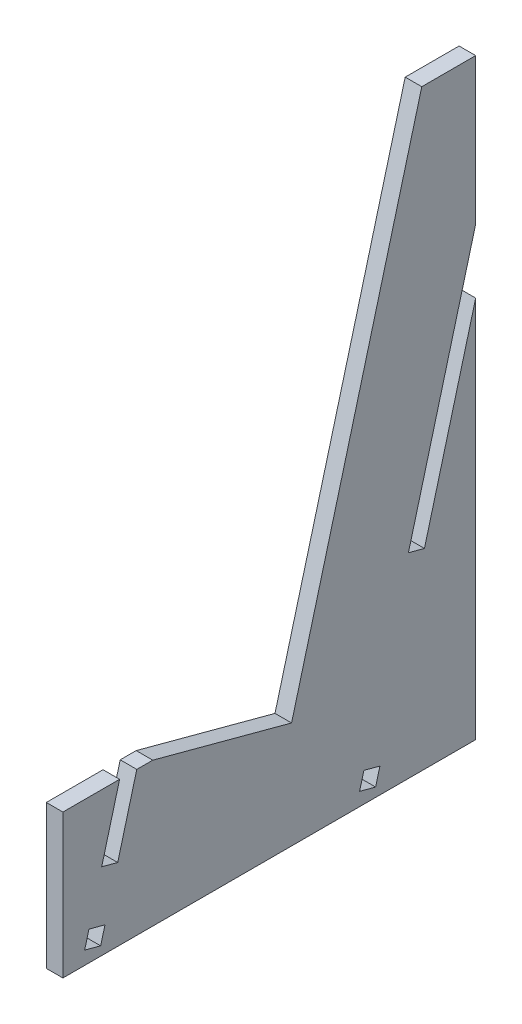
ISO-10303-21;
HEADER;
FILE_DESCRIPTION(('STEP AP214'),'2;1');
FILE_NAME('part.step','',(''),(''),'','','');
FILE_SCHEMA(('AUTOMOTIVE_DESIGN { 1 0 10303 214 1 1 1 1 }'));
ENDSEC;
DATA;
#1=APPLICATION_CONTEXT('core data for automotive mechanical design processes');
#2=APPLICATION_PROTOCOL_DEFINITION('international standard','automotive_design',2000,#1);
#3=PRODUCT_CONTEXT('',#1,'mechanical');
#4=PRODUCT('Part','Part','',(#3));
#5=PRODUCT_RELATED_PRODUCT_CATEGORY('part','',(#4));
#6=PRODUCT_DEFINITION_FORMATION('','',#4);
#7=PRODUCT_DEFINITION_CONTEXT('part definition',#1,'design');
#8=PRODUCT_DEFINITION('design','',#6,#7);
#9=PRODUCT_DEFINITION_SHAPE('','',#8);
#10=(LENGTH_UNIT() NAMED_UNIT(*) SI_UNIT(.MILLI.,.METRE.));
#11=(NAMED_UNIT(*) PLANE_ANGLE_UNIT() SI_UNIT($,.RADIAN.));
#12=(NAMED_UNIT(*) SI_UNIT($,.STERADIAN.) SOLID_ANGLE_UNIT());
#13=UNCERTAINTY_MEASURE_WITH_UNIT(LENGTH_MEASURE(1.E-05),#10,'distance_accuracy_value','');
#14=(GEOMETRIC_REPRESENTATION_CONTEXT(3) GLOBAL_UNCERTAINTY_ASSIGNED_CONTEXT((#13)) GLOBAL_UNIT_ASSIGNED_CONTEXT((#10,
#11,#12)) REPRESENTATION_CONTEXT('',''));
#15=CARTESIAN_POINT('',(0.,0.,0.));
#16=DIRECTION('',(0.,0.,1.));
#17=DIRECTION('',(1.,0.,0.));
#18=AXIS2_PLACEMENT_3D('',#15,#16,#17);
#19=CARTESIAN_POINT('',(2.93,0.,0.));
#20=DIRECTION('',(1.,0.,0.));
#21=DIRECTION('',(0.,0.,-1.));
#22=AXIS2_PLACEMENT_3D('',#19,#20,#21);
#23=PLANE('',#22);
#24=DIRECTION('',(0.,-0.96592582628907,0.258819045102513));
#25=VECTOR('',#24,1.);
#26=CARTESIAN_POINT('',(2.93,1.59227051614985,17.6834074311444));
#27=LINE('',#26,#25);
#28=CARTESIAN_POINT('',(2.93,4.42243318717682,16.925067628994));
#29=VERTEX_POINT('',#28);
#30=CARTESIAN_POINT('',(2.93,1.59227051614985,17.6834074311444));
#31=VERTEX_POINT('',#30);
#32=EDGE_CURVE('E194',#29,#31,#27,.T.);
#33=ORIENTED_EDGE('',*,*,#32,.T.);
#34=DIRECTION('',(0.,0.258819045102514,0.96592582628907));
#35=VECTOR('',#34,1.);
#36=CARTESIAN_POINT('',(2.93,1.59227051614985,17.6834074311444));
#37=LINE('',#36,#35);
#38=CARTESIAN_POINT('',(2.93,2.35061031830021,20.5135701021713));
#39=VERTEX_POINT('',#38);
#40=EDGE_CURVE('E203',#31,#39,#37,.T.);
#41=ORIENTED_EDGE('',*,*,#40,.T.);
#42=DIRECTION('',(0.,0.96592582628907,-0.258819045102513));
#43=VECTOR('',#42,1.);
#44=CARTESIAN_POINT('',(2.93,2.35061031830021,20.5135701021713));
#45=LINE('',#44,#43);
#46=CARTESIAN_POINT('',(2.93,5.18077298932718,19.755230300021));
#47=VERTEX_POINT('',#46);
#48=EDGE_CURVE('E52',#39,#47,#45,.T.);
#49=ORIENTED_EDGE('',*,*,#48,.T.);
#50=DIRECTION('',(0.,-0.258819045102514,-0.96592582628907));
#51=VECTOR('',#50,1.);
#52=CARTESIAN_POINT('',(2.93,4.42243318717682,16.925067628994));
#53=LINE('',#52,#51);
#54=EDGE_CURVE('E200',#47,#29,#53,.T.);
#55=ORIENTED_EDGE('',*,*,#54,.T.);
#56=EDGE_LOOP('',(#33,#41,#49,#55));
#57=FACE_BOUND('',#56,.T.);
#58=DIRECTION('',(0.,-0.96592582628907,0.258819045102515));
#59=VECTOR('',#58,1.);
#60=CARTESIAN_POINT('',(2.93,12.8324905834679,63.2566152430916));
#61=LINE('',#60,#59);
#62=CARTESIAN_POINT('',(2.93,25.4,59.8891612440614));
#63=VERTEX_POINT('',#62);
#64=CARTESIAN_POINT('',(2.93,12.8324905834679,63.2566152430916));
#65=VERTEX_POINT('',#64);
#66=EDGE_CURVE('E259',#63,#65,#61,.T.);
#67=ORIENTED_EDGE('',*,*,#66,.T.);
#68=DIRECTION('',(0.,0.258819045102516,0.96592582628907));
#69=VECTOR('',#68,1.);
#70=CARTESIAN_POINT('',(2.93,12.8324905834679,63.2566152430916));
#71=LINE('',#70,#69);
#72=CARTESIAN_POINT('',(2.93,13.5908303856183,66.0867779141186));
#73=VERTEX_POINT('',#72);
#74=EDGE_CURVE('E262',#65,#73,#71,.T.);
#75=ORIENTED_EDGE('',*,*,#74,.T.);
#76=DIRECTION('',(0.,0.96592582628907,-0.258819045102515));
#77=VECTOR('',#76,1.);
#78=CARTESIAN_POINT('',(2.93,13.5908303856183,66.0867779141186));
#79=LINE('',#78,#77);
#80=CARTESIAN_POINT('',(2.93,25.4,62.9225204526629));
#81=VERTEX_POINT('',#80);
#82=EDGE_CURVE('E266',#73,#81,#79,.T.);
#83=ORIENTED_EDGE('',*,*,#82,.T.);
#84=DIRECTION('',(0.,0.,1.));
#85=VECTOR('',#84,1.);
#86=CARTESIAN_POINT('',(2.93,25.4,57.0685290973559));
#87=LINE('',#86,#85);
#88=CARTESIAN_POINT('',(2.93,25.4,72.9435290973559));
#89=VERTEX_POINT('',#88);
#90=EDGE_CURVE('E322',#81,#89,#87,.T.);
#91=ORIENTED_EDGE('',*,*,#90,.T.);
#92=DIRECTION('',(0.,-1.,0.));
#93=VECTOR('',#92,1.);
#94=CARTESIAN_POINT('',(2.93,25.4,72.9435290973559));
#95=LINE('',#94,#93);
#96=CARTESIAN_POINT('',(2.93,0.,72.9435290973559));
#97=VERTEX_POINT('',#96);
#98=EDGE_CURVE('E326',#89,#97,#95,.T.);
#99=ORIENTED_EDGE('',*,*,#98,.T.);
#100=DIRECTION('',(0.,0.,-1.));
#101=VECTOR('',#100,1.);
#102=CARTESIAN_POINT('',(2.93,0.,72.9435290973559));
#103=LINE('',#102,#101);
#104=CARTESIAN_POINT('',(2.93,0.,0.));
#105=VERTEX_POINT('',#104);
#106=EDGE_CURVE('E308',#97,#105,#103,.T.);
#107=ORIENTED_EDGE('',*,*,#106,.T.);
#108=DIRECTION('',(0.,1.,0.));
#109=VECTOR('',#108,1.);
#110=CARTESIAN_POINT('',(2.93,0.,0.));
#111=LINE('',#110,#109);
#112=CARTESIAN_POINT('',(2.93,67.5876455001234,0.));
#113=VERTEX_POINT('',#112);
#114=EDGE_CURVE('E313',#105,#113,#111,.T.);
#115=ORIENTED_EDGE('',*,*,#114,.T.);
#116=DIRECTION('',(0.,-0.96592582628907,0.258819045102514));
#117=VECTOR('',#116,1.);
#118=CARTESIAN_POINT('',(2.93,4.52751375751954,16.8969113750305));
#119=LINE('',#118,#117);
#120=CARTESIAN_POINT('',(2.93,33.7938227500617,9.05502751503929));
#121=VERTEX_POINT('',#120);
#122=EDGE_CURVE('E278',#113,#121,#119,.T.);
#123=ORIENTED_EDGE('',*,*,#122,.T.);
#124=DIRECTION('',(0.,-0.258819045102513,-0.96592582628907));
#125=VECTOR('',#124,1.);
#126=CARTESIAN_POINT('',(2.93,29.2663089925422,-7.84188385999114));
#127=LINE('',#126,#125);
#128=CARTESIAN_POINT('',(2.93,34.5521625522121,11.8851901860663));
#129=VERTEX_POINT('',#128);
#130=EDGE_CURVE('E285',#129,#121,#127,.T.);
#131=ORIENTED_EDGE('',*,*,#130,.F.);
#132=DIRECTION('',(0.,-0.96592582628907,0.258819045102514));
#133=VECTOR('',#132,1.);
#134=CARTESIAN_POINT('',(2.93,5.2858535596699,19.7270740460574));
#135=LINE('',#134,#133);
#136=CARTESIAN_POINT('',(2.93,78.9082961842316,0.));
#137=VERTEX_POINT('',#136);
#138=EDGE_CURVE('E294',#137,#129,#135,.T.);
#139=ORIENTED_EDGE('',*,*,#138,.F.);
#140=CARTESIAN_POINT('',(2.93,104.696802211494,0.));
#141=VERTEX_POINT('',#140);
#142=EDGE_CURVE('E311',#137,#141,#111,.T.);
#143=ORIENTED_EDGE('',*,*,#142,.T.);
#144=DIRECTION('',(0.,0.,1.));
#145=VECTOR('',#144,1.);
#146=CARTESIAN_POINT('',(2.93,104.696802211494,0.));
#147=LINE('',#146,#145);
#148=CARTESIAN_POINT('',(2.93,104.696802211494,9.525));
#149=VERTEX_POINT('',#148);
#150=EDGE_CURVE('E316',#141,#149,#147,.T.);
#151=ORIENTED_EDGE('',*,*,#150,.T.);
#152=DIRECTION('',(0.,-0.96592582628907,0.258819045102514));
#153=VECTOR('',#152,1.);
#154=CARTESIAN_POINT('',(2.93,104.696802211494,9.525));
#155=LINE('',#154,#153);
#156=CARTESIAN_POINT('',(2.93,18.8259962543961,32.5340131096135));
#157=VERTEX_POINT('',#156);
#158=EDGE_CURVE('E318',#149,#157,#155,.T.);
#159=ORIENTED_EDGE('',*,*,#158,.T.);
#160=DIRECTION('',(0.,0.258819045102514,0.96592582628907));
#161=VECTOR('',#160,1.);
#162=CARTESIAN_POINT('',(2.93,18.8259962543961,32.5340131096135));
#163=LINE('',#162,#161);
#164=CARTESIAN_POINT('',(2.93,25.4,57.0685290973559));
#165=VERTEX_POINT('',#164);
#166=EDGE_CURVE('E320',#157,#165,#163,.T.);
#167=ORIENTED_EDGE('',*,*,#166,.T.);
#168=EDGE_CURVE('E323',#165,#63,#87,.T.);
#169=ORIENTED_EDGE('',*,*,#168,.T.);
#170=EDGE_LOOP('',(#67,#75,#83,#91,#99,#107,#115,#123,#131,#139,#143,#151,#159,#167,#169));
#171=FACE_BOUND('',#170,.T.);
#172=DIRECTION('',(0.,0.965925826289069,-0.258819045102519));
#173=VECTOR('',#172,1.);
#174=CARTESIAN_POINT('',(2.93,17.4321074851032,65.0575108174074));
#175=LINE('',#174,#173);
#176=CARTESIAN_POINT('',(2.93,2.34583980215033,69.0998640598543));
#177=VERTEX_POINT('',#176);
#178=CARTESIAN_POINT('',(2.93,5.17600247317732,68.341524257704));
#179=VERTEX_POINT('',#178);
#180=EDGE_CURVE('E236',#177,#179,#175,.T.);
#181=ORIENTED_EDGE('',*,*,#180,.T.);
#182=DIRECTION('',(0.,0.258819045102513,0.965925826289071));
#183=VECTOR('',#182,1.);
#184=CARTESIAN_POINT('',(2.93,-12.2561050119255,3.28401344029636));
#185=LINE('',#184,#183);
#186=CARTESIAN_POINT('',(2.93,4.41766267102695,65.5113615866769));
#187=VERTEX_POINT('',#186);
#188=EDGE_CURVE('E228',#187,#179,#185,.T.);
#189=ORIENTED_EDGE('',*,*,#188,.F.);
#190=DIRECTION('',(0.,0.965925826289068,-0.258819045102523));
#191=VECTOR('',#190,1.);
#192=CARTESIAN_POINT('',(2.93,16.6737676829531,62.2273481463803));
#193=LINE('',#192,#191);
#194=CARTESIAN_POINT('',(2.93,1.58749999999996,66.2697013888273));
#195=VERTEX_POINT('',#194);
#196=EDGE_CURVE('E230',#195,#187,#193,.T.);
#197=ORIENTED_EDGE('',*,*,#196,.F.);
#198=DIRECTION('',(0.,0.258819045102514,0.96592582628907));
#199=VECTOR('',#198,1.);
#200=CARTESIAN_POINT('',(2.93,-15.0862676829526,4.04235324244677));
#201=LINE('',#200,#199);
#202=EDGE_CURVE('E233',#195,#177,#201,.T.);
#203=ORIENTED_EDGE('',*,*,#202,.T.);
#204=EDGE_LOOP('',(#181,#189,#197,#203));
#205=FACE_BOUND('',#204,.T.);
#206=ADVANCED_FACE('F37',(#57,#171,#205),#23,.T.);
#207=CARTESIAN_POINT('',(0.,0.,0.));
#208=DIRECTION('',(1.,0.,0.));
#209=DIRECTION('',(0.,0.,-1.));
#210=AXIS2_PLACEMENT_3D('',#207,#208,#209);
#211=PLANE('',#210);
#212=DIRECTION('',(0.,0.258819045102514,0.96592582628907));
#213=VECTOR('',#212,1.);
#214=CARTESIAN_POINT('',(0.,1.59227051614985,17.6834074311444));
#215=LINE('',#214,#213);
#216=CARTESIAN_POINT('',(0.,1.59227051614985,17.6834074311443));
#217=VERTEX_POINT('',#216);
#218=CARTESIAN_POINT('',(0.,2.35061031830021,20.5135701021713));
#219=VERTEX_POINT('',#218);
#220=EDGE_CURVE('E218',#217,#219,#215,.T.);
#221=ORIENTED_EDGE('',*,*,#220,.F.);
#222=DIRECTION('',(0.,-0.96592582628907,0.258819045102513));
#223=VECTOR('',#222,1.);
#224=CARTESIAN_POINT('',(0.,1.59227051614985,17.6834074311444));
#225=LINE('',#224,#223);
#226=CARTESIAN_POINT('',(0.,4.42243318717682,16.925067628994));
#227=VERTEX_POINT('',#226);
#228=EDGE_CURVE('E60',#227,#217,#225,.T.);
#229=ORIENTED_EDGE('',*,*,#228,.F.);
#230=DIRECTION('',(0.,-0.258819045102514,-0.96592582628907));
#231=VECTOR('',#230,1.);
#232=CARTESIAN_POINT('',(0.,4.42243318717682,16.925067628994));
#233=LINE('',#232,#231);
#234=CARTESIAN_POINT('',(0.,5.18077298932718,19.755230300021));
#235=VERTEX_POINT('',#234);
#236=EDGE_CURVE('E209',#235,#227,#233,.T.);
#237=ORIENTED_EDGE('',*,*,#236,.F.);
#238=DIRECTION('',(0.,0.96592582628907,-0.258819045102513));
#239=VECTOR('',#238,1.);
#240=CARTESIAN_POINT('',(0.,2.35061031830021,20.5135701021713));
#241=LINE('',#240,#239);
#242=EDGE_CURVE('E212',#219,#235,#241,.T.);
#243=ORIENTED_EDGE('',*,*,#242,.F.);
#244=EDGE_LOOP('',(#221,#229,#237,#243));
#245=FACE_BOUND('',#244,.T.);
#246=DIRECTION('',(0.,0.258819045102516,0.96592582628907));
#247=VECTOR('',#246,1.);
#248=CARTESIAN_POINT('',(0.,12.8324905834679,63.2566152430916));
#249=LINE('',#248,#247);
#250=CARTESIAN_POINT('',(0.,12.8324905834679,63.2566152430916));
#251=VERTEX_POINT('',#250);
#252=CARTESIAN_POINT('',(0.,13.5908303856183,66.0867779141186));
#253=VERTEX_POINT('',#252);
#254=EDGE_CURVE('E272',#251,#253,#249,.T.);
#255=ORIENTED_EDGE('',*,*,#254,.F.);
#256=DIRECTION('',(0.,-0.96592582628907,0.258819045102515));
#257=VECTOR('',#256,1.);
#258=CARTESIAN_POINT('',(0.,12.8324905834679,63.2566152430916));
#259=LINE('',#258,#257);
#260=CARTESIAN_POINT('',(0.,25.4,59.8891612440614));
#261=VERTEX_POINT('',#260);
#262=EDGE_CURVE('E252',#261,#251,#259,.T.);
#263=ORIENTED_EDGE('',*,*,#262,.F.);
#264=DIRECTION('',(0.,0.,1.));
#265=VECTOR('',#264,1.);
#266=CARTESIAN_POINT('',(0.,25.4,57.0685290973559));
#267=LINE('',#266,#265);
#268=CARTESIAN_POINT('',(0.,25.4,57.0685290973559));
#269=VERTEX_POINT('',#268);
#270=EDGE_CURVE('E342',#269,#261,#267,.T.);
#271=ORIENTED_EDGE('',*,*,#270,.F.);
#272=DIRECTION('',(0.,0.258819045102514,0.96592582628907));
#273=VECTOR('',#272,1.);
#274=CARTESIAN_POINT('',(0.,18.8259962543961,32.5340131096135));
#275=LINE('',#274,#273);
#276=CARTESIAN_POINT('',(0.,18.8259962543961,32.5340131096135));
#277=VERTEX_POINT('',#276);
#278=EDGE_CURVE('E339',#277,#269,#275,.T.);
#279=ORIENTED_EDGE('',*,*,#278,.F.);
#280=DIRECTION('',(0.,-0.96592582628907,0.258819045102514));
#281=VECTOR('',#280,1.);
#282=CARTESIAN_POINT('',(0.,104.696802211494,9.525));
#283=LINE('',#282,#281);
#284=CARTESIAN_POINT('',(0.,104.696802211494,9.525));
#285=VERTEX_POINT('',#284);
#286=EDGE_CURVE('E337',#285,#277,#283,.T.);
#287=ORIENTED_EDGE('',*,*,#286,.F.);
#288=DIRECTION('',(0.,0.,1.));
#289=VECTOR('',#288,1.);
#290=CARTESIAN_POINT('',(0.,104.696802211494,0.));
#291=LINE('',#290,#289);
#292=CARTESIAN_POINT('',(0.,104.696802211494,0.));
#293=VERTEX_POINT('',#292);
#294=EDGE_CURVE('E335',#293,#285,#291,.T.);
#295=ORIENTED_EDGE('',*,*,#294,.F.);
#296=DIRECTION('',(0.,1.,0.));
#297=VECTOR('',#296,1.);
#298=CARTESIAN_POINT('',(0.,0.,0.));
#299=LINE('',#298,#297);
#300=CARTESIAN_POINT('',(0.,78.9082961842316,0.));
#301=VERTEX_POINT('',#300);
#302=EDGE_CURVE('E331',#301,#293,#299,.T.);
#303=ORIENTED_EDGE('',*,*,#302,.F.);
#304=DIRECTION('',(0.,-0.96592582628907,0.258819045102514));
#305=VECTOR('',#304,1.);
#306=CARTESIAN_POINT('',(0.,5.2858535596699,19.7270740460574));
#307=LINE('',#306,#305);
#308=CARTESIAN_POINT('',(0.,34.5521625522121,11.8851901860663));
#309=VERTEX_POINT('',#308);
#310=EDGE_CURVE('E284',#301,#309,#307,.T.);
#311=ORIENTED_EDGE('',*,*,#310,.T.);
#312=DIRECTION('',(0.,-0.258819045102513,-0.96592582628907));
#313=VECTOR('',#312,1.);
#314=CARTESIAN_POINT('',(0.,29.2663089925422,-7.84188385999114));
#315=LINE('',#314,#313);
#316=CARTESIAN_POINT('',(0.,33.7938227500617,9.05502751503929));
#317=VERTEX_POINT('',#316);
#318=EDGE_CURVE('E288',#309,#317,#315,.T.);
#319=ORIENTED_EDGE('',*,*,#318,.T.);
#320=DIRECTION('',(0.,-0.96592582628907,0.258819045102514));
#321=VECTOR('',#320,1.);
#322=CARTESIAN_POINT('',(0.,4.52751375751954,16.8969113750305));
#323=LINE('',#322,#321);
#324=CARTESIAN_POINT('',(0.,67.5876455001234,0.));
#325=VERTEX_POINT('',#324);
#326=EDGE_CURVE('E282',#325,#317,#323,.T.);
#327=ORIENTED_EDGE('',*,*,#326,.F.);
#328=CARTESIAN_POINT('',(0.,0.,0.));
#329=VERTEX_POINT('',#328);
#330=EDGE_CURVE('E332',#329,#325,#299,.T.);
#331=ORIENTED_EDGE('',*,*,#330,.F.);
#332=DIRECTION('',(0.,0.,-1.));
#333=VECTOR('',#332,1.);
#334=CARTESIAN_POINT('',(0.,0.,72.9435290973559));
#335=LINE('',#334,#333);
#336=CARTESIAN_POINT('',(0.,0.,72.9435290973559));
#337=VERTEX_POINT('',#336);
#338=EDGE_CURVE('E301',#337,#329,#335,.T.);
#339=ORIENTED_EDGE('',*,*,#338,.F.);
#340=DIRECTION('',(0.,-1.,0.));
#341=VECTOR('',#340,1.);
#342=CARTESIAN_POINT('',(0.,25.4,72.9435290973559));
#343=LINE('',#342,#341);
#344=CARTESIAN_POINT('',(0.,25.4,72.9435290973559));
#345=VERTEX_POINT('',#344);
#346=EDGE_CURVE('E312',#345,#337,#343,.T.);
#347=ORIENTED_EDGE('',*,*,#346,.F.);
#348=CARTESIAN_POINT('',(0.,25.4,62.9225204526629));
#349=VERTEX_POINT('',#348);
#350=EDGE_CURVE('E341',#349,#345,#267,.T.);
#351=ORIENTED_EDGE('',*,*,#350,.F.);
#352=DIRECTION('',(0.,0.96592582628907,-0.258819045102515));
#353=VECTOR('',#352,1.);
#354=CARTESIAN_POINT('',(0.,13.5908303856183,66.0867779141186));
#355=LINE('',#354,#353);
#356=EDGE_CURVE('E263',#253,#349,#355,.T.);
#357=ORIENTED_EDGE('',*,*,#356,.F.);
#358=EDGE_LOOP('',(#255,#263,#271,#279,#287,#295,#303,#311,#319,#327,#331,#339,#347,#351,#357));
#359=FACE_BOUND('',#358,.T.);
#360=DIRECTION('',(0.,0.258819045102513,0.965925826289071));
#361=VECTOR('',#360,1.);
#362=CARTESIAN_POINT('',(0.,-12.2561050119255,3.28401344029636));
#363=LINE('',#362,#361);
#364=CARTESIAN_POINT('',(0.,4.41766267102695,65.5113615866769));
#365=VERTEX_POINT('',#364);
#366=CARTESIAN_POINT('',(0.,5.17600247317732,68.341524257704));
#367=VERTEX_POINT('',#366);
#368=EDGE_CURVE('E224',#365,#367,#363,.T.);
#369=ORIENTED_EDGE('',*,*,#368,.T.);
#370=DIRECTION('',(0.,0.965925826289069,-0.258819045102519));
#371=VECTOR('',#370,1.);
#372=CARTESIAN_POINT('',(0.,17.4321074851032,65.0575108174074));
#373=LINE('',#372,#371);
#374=CARTESIAN_POINT('',(0.,2.34583980215033,69.0998640598543));
#375=VERTEX_POINT('',#374);
#376=EDGE_CURVE('E231',#375,#367,#373,.T.);
#377=ORIENTED_EDGE('',*,*,#376,.F.);
#378=DIRECTION('',(0.,0.258819045102514,0.96592582628907));
#379=VECTOR('',#378,1.);
#380=CARTESIAN_POINT('',(0.,-15.0862676829526,4.04235324244677));
#381=LINE('',#380,#379);
#382=CARTESIAN_POINT('',(0.,1.58749999999996,66.2697013888273));
#383=VERTEX_POINT('',#382);
#384=EDGE_CURVE('E245',#383,#375,#381,.T.);
#385=ORIENTED_EDGE('',*,*,#384,.F.);
#386=DIRECTION('',(0.,0.965925826289068,-0.258819045102523));
#387=VECTOR('',#386,1.);
#388=CARTESIAN_POINT('',(0.,16.6737676829531,62.2273481463803));
#389=LINE('',#388,#387);
#390=EDGE_CURVE('E242',#383,#365,#389,.T.);
#391=ORIENTED_EDGE('',*,*,#390,.T.);
#392=EDGE_LOOP('',(#369,#377,#385,#391));
#393=FACE_BOUND('',#392,.T.);
#394=ADVANCED_FACE('F373',(#245,#359,#393),#211,.F.);
#395=CARTESIAN_POINT('',(2.93,25.4,57.0685290973559));
#396=DIRECTION('',(0.,-1.,0.));
#397=DIRECTION('',(0.,0.,-1.));
#398=AXIS2_PLACEMENT_3D('',#395,#396,#397);
#399=PLANE('',#398);
#400=ORIENTED_EDGE('',*,*,#270,.T.);
#401=DIRECTION('',(-1.,0.,0.));
#402=VECTOR('',#401,1.);
#403=CARTESIAN_POINT('',(2.93,25.4,59.8891612440614));
#404=LINE('',#403,#402);
#405=EDGE_CURVE('E276',#63,#261,#404,.T.);
#406=ORIENTED_EDGE('',*,*,#405,.F.);
#407=ORIENTED_EDGE('',*,*,#168,.F.);
#408=DIRECTION('',(-1.,0.,0.));
#409=VECTOR('',#408,1.);
#410=CARTESIAN_POINT('',(2.93,25.4,57.0685290973559));
#411=LINE('',#410,#409);
#412=EDGE_CURVE('E351',#165,#269,#411,.T.);
#413=ORIENTED_EDGE('',*,*,#412,.T.);
#414=EDGE_LOOP('',(#400,#406,#407,#413));
#415=FACE_BOUND('',#414,.T.);
#416=ADVANCED_FACE('F407',(#415),#399,.F.);
#417=CARTESIAN_POINT('',(2.93,0.,0.));
#418=DIRECTION('',(0.,0.,1.));
#419=DIRECTION('',(1.,0.,0.));
#420=AXIS2_PLACEMENT_3D('',#417,#418,#419);
#421=PLANE('',#420);
#422=DIRECTION('',(1.,0.,0.));
#423=VECTOR('',#422,1.);
#424=CARTESIAN_POINT('',(0.,67.5876455001234,0.));
#425=LINE('',#424,#423);
#426=EDGE_CURVE('E291',#325,#113,#425,.T.);
#427=ORIENTED_EDGE('',*,*,#426,.T.);
#428=ORIENTED_EDGE('',*,*,#114,.F.);
#429=DIRECTION('',(-1.,0.,0.));
#430=VECTOR('',#429,1.);
#431=CARTESIAN_POINT('',(2.93,0.,0.));
#432=LINE('',#431,#430);
#433=EDGE_CURVE('E45',#105,#329,#432,.T.);
#434=ORIENTED_EDGE('',*,*,#433,.T.);
#435=ORIENTED_EDGE('',*,*,#330,.T.);
#436=EDGE_LOOP('',(#427,#428,#434,#435));
#437=FACE_BOUND('',#436,.T.);
#438=ADVANCED_FACE('F365',(#437),#421,.F.);
#439=CARTESIAN_POINT('',(2.93,0.,72.9435290973559));
#440=DIRECTION('',(0.,1.,0.));
#441=DIRECTION('',(0.,0.,1.));
#442=AXIS2_PLACEMENT_3D('',#439,#440,#441);
#443=PLANE('',#442);
#444=ORIENTED_EDGE('',*,*,#338,.T.);
#445=ORIENTED_EDGE('',*,*,#433,.F.);
#446=ORIENTED_EDGE('',*,*,#106,.F.);
#447=DIRECTION('',(-1.,0.,0.));
#448=VECTOR('',#447,1.);
#449=CARTESIAN_POINT('',(2.93,0.,72.9435290973559));
#450=LINE('',#449,#448);
#451=EDGE_CURVE('E328',#97,#337,#450,.T.);
#452=ORIENTED_EDGE('',*,*,#451,.T.);
#453=EDGE_LOOP('',(#444,#445,#446,#452));
#454=FACE_BOUND('',#453,.T.);
#455=ADVANCED_FACE('F39',(#454),#443,.F.);
#456=ORIENTED_EDGE('',*,*,#142,.F.);
#457=DIRECTION('',(1.,0.,0.));
#458=VECTOR('',#457,1.);
#459=CARTESIAN_POINT('',(0.,78.9082961842316,0.));
#460=LINE('',#459,#458);
#461=EDGE_CURVE('E304',#301,#137,#460,.T.);
#462=ORIENTED_EDGE('',*,*,#461,.F.);
#463=ORIENTED_EDGE('',*,*,#302,.T.);
#464=DIRECTION('',(-1.,0.,0.));
#465=VECTOR('',#464,1.);
#466=CARTESIAN_POINT('',(2.93,104.696802211494,0.));
#467=LINE('',#466,#465);
#468=EDGE_CURVE('E360',#141,#293,#467,.T.);
#469=ORIENTED_EDGE('',*,*,#468,.F.);
#470=EDGE_LOOP('',(#456,#462,#463,#469));
#471=FACE_BOUND('',#470,.T.);
#472=ADVANCED_FACE('F427',(#471),#421,.F.);
#473=CARTESIAN_POINT('',(2.93,104.696802211494,0.));
#474=DIRECTION('',(0.,-1.,0.));
#475=DIRECTION('',(0.,0.,-1.));
#476=AXIS2_PLACEMENT_3D('',#473,#474,#475);
#477=PLANE('',#476);
#478=ORIENTED_EDGE('',*,*,#294,.T.);
#479=DIRECTION('',(-1.,0.,0.));
#480=VECTOR('',#479,1.);
#481=CARTESIAN_POINT('',(2.93,104.696802211494,9.525));
#482=LINE('',#481,#480);
#483=EDGE_CURVE('E357',#149,#285,#482,.T.);
#484=ORIENTED_EDGE('',*,*,#483,.F.);
#485=ORIENTED_EDGE('',*,*,#150,.F.);
#486=ORIENTED_EDGE('',*,*,#468,.T.);
#487=EDGE_LOOP('',(#478,#484,#485,#486));
#488=FACE_BOUND('',#487,.T.);
#489=ADVANCED_FACE('F423',(#488),#477,.F.);
#490=CARTESIAN_POINT('',(2.93,104.696802211494,9.525));
#491=DIRECTION('',(0.,-0.258819045102514,-0.96592582628907));
#492=DIRECTION('',(0.,0.96592582628907,-0.258819045102514));
#493=AXIS2_PLACEMENT_3D('',#490,#491,#492);
#494=PLANE('',#493);
#495=ORIENTED_EDGE('',*,*,#286,.T.);
#496=DIRECTION('',(-1.,0.,0.));
#497=VECTOR('',#496,1.);
#498=CARTESIAN_POINT('',(2.93,18.8259962543961,32.5340131096135));
#499=LINE('',#498,#497);
#500=EDGE_CURVE('E354',#157,#277,#499,.T.);
#501=ORIENTED_EDGE('',*,*,#500,.F.);
#502=ORIENTED_EDGE('',*,*,#158,.F.);
#503=ORIENTED_EDGE('',*,*,#483,.T.);
#504=EDGE_LOOP('',(#495,#501,#502,#503));
#505=FACE_BOUND('',#504,.T.);
#506=ADVANCED_FACE('F418',(#505),#494,.F.);
#507=CARTESIAN_POINT('',(2.93,18.8259962543961,32.5340131096135));
#508=DIRECTION('',(0.,-0.96592582628907,0.258819045102514));
#509=DIRECTION('',(0.,-0.258819045102514,-0.96592582628907));
#510=AXIS2_PLACEMENT_3D('',#507,#508,#509);
#511=PLANE('',#510);
#512=ORIENTED_EDGE('',*,*,#278,.T.);
#513=ORIENTED_EDGE('',*,*,#412,.F.);
#514=ORIENTED_EDGE('',*,*,#166,.F.);
#515=ORIENTED_EDGE('',*,*,#500,.T.);
#516=EDGE_LOOP('',(#512,#513,#514,#515));
#517=FACE_BOUND('',#516,.T.);
#518=ADVANCED_FACE('F412',(#517),#511,.F.);
#519=ORIENTED_EDGE('',*,*,#90,.F.);
#520=DIRECTION('',(-1.,0.,0.));
#521=VECTOR('',#520,1.);
#522=CARTESIAN_POINT('',(2.93,25.4,62.9225204526629));
#523=LINE('',#522,#521);
#524=EDGE_CURVE('E11',#81,#349,#523,.T.);
#525=ORIENTED_EDGE('',*,*,#524,.T.);
#526=ORIENTED_EDGE('',*,*,#350,.T.);
#527=DIRECTION('',(-1.,0.,0.));
#528=VECTOR('',#527,1.);
#529=CARTESIAN_POINT('',(2.93,25.4,72.9435290973559));
#530=LINE('',#529,#528);
#531=EDGE_CURVE('E348',#89,#345,#530,.T.);
#532=ORIENTED_EDGE('',*,*,#531,.F.);
#533=EDGE_LOOP('',(#519,#525,#526,#532));
#534=FACE_BOUND('',#533,.T.);
#535=ADVANCED_FACE('F392',(#534),#399,.F.);
#536=CARTESIAN_POINT('',(2.93,25.4,72.9435290973559));
#537=DIRECTION('',(0.,0.,-1.));
#538=DIRECTION('',(-1.,0.,0.));
#539=AXIS2_PLACEMENT_3D('',#536,#537,#538);
#540=PLANE('',#539);
#541=ORIENTED_EDGE('',*,*,#346,.T.);
#542=ORIENTED_EDGE('',*,*,#451,.F.);
#543=ORIENTED_EDGE('',*,*,#98,.F.);
#544=ORIENTED_EDGE('',*,*,#531,.T.);
#545=EDGE_LOOP('',(#541,#542,#543,#544));
#546=FACE_BOUND('',#545,.T.);
#547=ADVANCED_FACE('F390',(#546),#540,.F.);
#548=CARTESIAN_POINT('',(0.,4.52751375751954,16.8969113750305));
#549=DIRECTION('',(0.,0.258819045102514,0.96592582628907));
#550=DIRECTION('',(0.,-0.96592582628907,0.258819045102514));
#551=AXIS2_PLACEMENT_3D('',#548,#549,#550);
#552=PLANE('',#551);
#553=ORIENTED_EDGE('',*,*,#122,.F.);
#554=ORIENTED_EDGE('',*,*,#426,.F.);
#555=ORIENTED_EDGE('',*,*,#326,.T.);
#556=DIRECTION('',(1.,0.,0.));
#557=VECTOR('',#556,1.);
#558=CARTESIAN_POINT('',(0.,33.7938227500617,9.05502751503929));
#559=LINE('',#558,#557);
#560=EDGE_CURVE('E299',#317,#121,#559,.T.);
#561=ORIENTED_EDGE('',*,*,#560,.T.);
#562=EDGE_LOOP('',(#553,#554,#555,#561));
#563=FACE_BOUND('',#562,.T.);
#564=ADVANCED_FACE('F379',(#563),#552,.T.);
#565=CARTESIAN_POINT('',(0.,29.2663089925422,-7.84188385999114));
#566=DIRECTION('',(0.,-0.96592582628907,0.258819045102513));
#567=DIRECTION('',(0.,-0.258819045102513,-0.96592582628907));
#568=AXIS2_PLACEMENT_3D('',#565,#566,#567);
#569=PLANE('',#568);
#570=ORIENTED_EDGE('',*,*,#130,.T.);
#571=ORIENTED_EDGE('',*,*,#560,.F.);
#572=ORIENTED_EDGE('',*,*,#318,.F.);
#573=DIRECTION('',(1.,0.,0.));
#574=VECTOR('',#573,1.);
#575=CARTESIAN_POINT('',(0.,34.5521625522121,11.8851901860663));
#576=LINE('',#575,#574);
#577=EDGE_CURVE('E302',#309,#129,#576,.T.);
#578=ORIENTED_EDGE('',*,*,#577,.T.);
#579=EDGE_LOOP('',(#570,#571,#572,#578));
#580=FACE_BOUND('',#579,.T.);
#581=ADVANCED_FACE('F381',(#580),#569,.F.);
#582=CARTESIAN_POINT('',(0.,5.2858535596699,19.7270740460574));
#583=DIRECTION('',(0.,0.258819045102514,0.96592582628907));
#584=DIRECTION('',(0.,-0.96592582628907,0.258819045102514));
#585=AXIS2_PLACEMENT_3D('',#582,#583,#584);
#586=PLANE('',#585);
#587=ORIENTED_EDGE('',*,*,#138,.T.);
#588=ORIENTED_EDGE('',*,*,#577,.F.);
#589=ORIENTED_EDGE('',*,*,#310,.F.);
#590=ORIENTED_EDGE('',*,*,#461,.T.);
#591=EDGE_LOOP('',(#587,#588,#589,#590));
#592=FACE_BOUND('',#591,.T.);
#593=ADVANCED_FACE('F430',(#592),#586,.F.);
#594=CARTESIAN_POINT('',(2.93,13.5908303856183,66.0867779141186));
#595=DIRECTION('',(0.,0.258819045102515,0.96592582628907));
#596=DIRECTION('',(0.,-0.96592582628907,0.258819045102515));
#597=AXIS2_PLACEMENT_3D('',#594,#595,#596);
#598=PLANE('',#597);
#599=ORIENTED_EDGE('',*,*,#82,.F.);
#600=DIRECTION('',(-1.,0.,0.));
#601=VECTOR('',#600,1.);
#602=CARTESIAN_POINT('',(2.93,13.5908303856183,66.0867779141186));
#603=LINE('',#602,#601);
#604=EDGE_CURVE('E279',#73,#253,#603,.T.);
#605=ORIENTED_EDGE('',*,*,#604,.T.);
#606=ORIENTED_EDGE('',*,*,#356,.T.);
#607=ORIENTED_EDGE('',*,*,#524,.F.);
#608=EDGE_LOOP('',(#599,#605,#606,#607));
#609=FACE_BOUND('',#608,.T.);
#610=ADVANCED_FACE('F397',(#609),#598,.F.);
#611=CARTESIAN_POINT('',(2.93,12.8324905834679,63.2566152430916));
#612=DIRECTION('',(0.,-0.258819045102515,-0.96592582628907));
#613=DIRECTION('',(0.,0.96592582628907,-0.258819045102515));
#614=AXIS2_PLACEMENT_3D('',#611,#612,#613);
#615=PLANE('',#614);
#616=ORIENTED_EDGE('',*,*,#262,.T.);
#617=DIRECTION('',(-1.,0.,0.));
#618=VECTOR('',#617,1.);
#619=CARTESIAN_POINT('',(2.93,12.8324905834679,63.2566152430916));
#620=LINE('',#619,#618);
#621=EDGE_CURVE('E269',#65,#251,#620,.T.);
#622=ORIENTED_EDGE('',*,*,#621,.F.);
#623=ORIENTED_EDGE('',*,*,#66,.F.);
#624=ORIENTED_EDGE('',*,*,#405,.T.);
#625=EDGE_LOOP('',(#616,#622,#623,#624));
#626=FACE_BOUND('',#625,.T.);
#627=ADVANCED_FACE('F402',(#626),#615,.F.);
#628=CARTESIAN_POINT('',(2.93,12.8324905834679,63.2566152430916));
#629=DIRECTION('',(0.,-0.96592582628907,0.258819045102516));
#630=DIRECTION('',(0.,-0.258819045102516,-0.96592582628907));
#631=AXIS2_PLACEMENT_3D('',#628,#629,#630);
#632=PLANE('',#631);
#633=ORIENTED_EDGE('',*,*,#254,.T.);
#634=ORIENTED_EDGE('',*,*,#604,.F.);
#635=ORIENTED_EDGE('',*,*,#74,.F.);
#636=ORIENTED_EDGE('',*,*,#621,.T.);
#637=EDGE_LOOP('',(#633,#634,#635,#636));
#638=FACE_BOUND('',#637,.T.);
#639=ADVANCED_FACE('F400',(#638),#632,.F.);
#640=CARTESIAN_POINT('',(2.93,-12.2561050119255,3.28401344029636));
#641=DIRECTION('',(0.,-0.965925826289071,0.258819045102513));
#642=DIRECTION('',(0.,-0.258819045102513,-0.965925826289071));
#643=AXIS2_PLACEMENT_3D('',#640,#641,#642);
#644=PLANE('',#643);
#645=ORIENTED_EDGE('',*,*,#368,.F.);
#646=DIRECTION('',(-1.,0.,0.));
#647=VECTOR('',#646,1.);
#648=CARTESIAN_POINT('',(2.93,4.41766267102695,65.5113615866769));
#649=LINE('',#648,#647);
#650=EDGE_CURVE('E239',#187,#365,#649,.T.);
#651=ORIENTED_EDGE('',*,*,#650,.F.);
#652=ORIENTED_EDGE('',*,*,#188,.T.);
#653=DIRECTION('',(-1.,0.,0.));
#654=VECTOR('',#653,1.);
#655=CARTESIAN_POINT('',(2.93,5.17600247317732,68.341524257704));
#656=LINE('',#655,#654);
#657=EDGE_CURVE('E250',#179,#367,#656,.T.);
#658=ORIENTED_EDGE('',*,*,#657,.T.);
#659=EDGE_LOOP('',(#645,#651,#652,#658));
#660=FACE_BOUND('',#659,.T.);
#661=ADVANCED_FACE('F549',(#660),#644,.T.);
#662=CARTESIAN_POINT('',(2.93,17.4321074851032,65.0575108174074));
#663=DIRECTION('',(0.,0.258819045102519,0.965925826289069));
#664=DIRECTION('',(0.,-0.965925826289069,0.258819045102519));
#665=AXIS2_PLACEMENT_3D('',#662,#663,#664);
#666=PLANE('',#665);
#667=ORIENTED_EDGE('',*,*,#376,.T.);
#668=ORIENTED_EDGE('',*,*,#657,.F.);
#669=ORIENTED_EDGE('',*,*,#180,.F.);
#670=DIRECTION('',(-1.,0.,0.));
#671=VECTOR('',#670,1.);
#672=CARTESIAN_POINT('',(2.93,2.34583980215033,69.0998640598543));
#673=LINE('',#672,#671);
#674=EDGE_CURVE('E253',#177,#375,#673,.T.);
#675=ORIENTED_EDGE('',*,*,#674,.T.);
#676=EDGE_LOOP('',(#667,#668,#669,#675));
#677=FACE_BOUND('',#676,.T.);
#678=ADVANCED_FACE('F540',(#677),#666,.F.);
#679=CARTESIAN_POINT('',(2.93,-15.0862676829526,4.04235324244677));
#680=DIRECTION('',(0.,-0.96592582628907,0.258819045102514));
#681=DIRECTION('',(0.,-0.258819045102514,-0.96592582628907));
#682=AXIS2_PLACEMENT_3D('',#679,#680,#681);
#683=PLANE('',#682);
#684=ORIENTED_EDGE('',*,*,#384,.T.);
#685=ORIENTED_EDGE('',*,*,#674,.F.);
#686=ORIENTED_EDGE('',*,*,#202,.F.);
#687=DIRECTION('',(-1.,0.,0.));
#688=VECTOR('',#687,1.);
#689=CARTESIAN_POINT('',(2.93,1.58749999999996,66.2697013888273));
#690=LINE('',#689,#688);
#691=EDGE_CURVE('E255',#195,#383,#690,.T.);
#692=ORIENTED_EDGE('',*,*,#691,.T.);
#693=EDGE_LOOP('',(#684,#685,#686,#692));
#694=FACE_BOUND('',#693,.T.);
#695=ADVANCED_FACE('F530',(#694),#683,.F.);
#696=CARTESIAN_POINT('',(2.93,16.6737676829531,62.2273481463803));
#697=DIRECTION('',(0.,0.258819045102523,0.965925826289068));
#698=DIRECTION('',(0.,-0.965925826289068,0.258819045102523));
#699=AXIS2_PLACEMENT_3D('',#696,#697,#698);
#700=PLANE('',#699);
#701=ORIENTED_EDGE('',*,*,#390,.F.);
#702=ORIENTED_EDGE('',*,*,#691,.F.);
#703=ORIENTED_EDGE('',*,*,#196,.T.);
#704=ORIENTED_EDGE('',*,*,#650,.T.);
#705=EDGE_LOOP('',(#701,#702,#703,#704));
#706=FACE_BOUND('',#705,.T.);
#707=ADVANCED_FACE('F487',(#706),#700,.T.);
#708=CARTESIAN_POINT('',(2.93,1.59227051614985,17.6834074311444));
#709=DIRECTION('',(0.,-0.258819045102513,-0.96592582628907));
#710=DIRECTION('',(0.,0.96592582628907,-0.258819045102513));
#711=AXIS2_PLACEMENT_3D('',#708,#709,#710);
#712=PLANE('',#711);
#713=ORIENTED_EDGE('',*,*,#228,.T.);
#714=DIRECTION('',(-1.,0.,0.));
#715=VECTOR('',#714,1.);
#716=CARTESIAN_POINT('',(2.93,1.59227051614985,17.6834074311444));
#717=LINE('',#716,#715);
#718=EDGE_CURVE('E190',#31,#217,#717,.T.);
#719=ORIENTED_EDGE('',*,*,#718,.F.);
#720=ORIENTED_EDGE('',*,*,#32,.F.);
#721=DIRECTION('',(-1.,0.,0.));
#722=VECTOR('',#721,1.);
#723=CARTESIAN_POINT('',(2.93,4.42243318717682,16.925067628994));
#724=LINE('',#723,#722);
#725=EDGE_CURVE('E222',#29,#227,#724,.T.);
#726=ORIENTED_EDGE('',*,*,#725,.T.);
#727=EDGE_LOOP('',(#713,#719,#720,#726));
#728=FACE_BOUND('',#727,.T.);
#729=ADVANCED_FACE('F192',(#728),#712,.F.);
#730=CARTESIAN_POINT('',(2.93,4.42243318717682,16.925067628994));
#731=DIRECTION('',(0.,0.96592582628907,-0.258819045102514));
#732=DIRECTION('',(0.,0.258819045102514,0.96592582628907));
#733=AXIS2_PLACEMENT_3D('',#730,#731,#732);
#734=PLANE('',#733);
#735=ORIENTED_EDGE('',*,*,#236,.T.);
#736=ORIENTED_EDGE('',*,*,#725,.F.);
#737=ORIENTED_EDGE('',*,*,#54,.F.);
#738=DIRECTION('',(-1.,0.,0.));
#739=VECTOR('',#738,1.);
#740=CARTESIAN_POINT('',(2.93,5.18077298932718,19.755230300021));
#741=LINE('',#740,#739);
#742=EDGE_CURVE('E225',#47,#235,#741,.T.);
#743=ORIENTED_EDGE('',*,*,#742,.T.);
#744=EDGE_LOOP('',(#735,#736,#737,#743));
#745=FACE_BOUND('',#744,.T.);
#746=ADVANCED_FACE('F486',(#745),#734,.F.);
#747=CARTESIAN_POINT('',(2.93,2.35061031830021,20.5135701021713));
#748=DIRECTION('',(0.,0.258819045102513,0.96592582628907));
#749=DIRECTION('',(0.,-0.96592582628907,0.258819045102513));
#750=AXIS2_PLACEMENT_3D('',#747,#748,#749);
#751=PLANE('',#750);
#752=ORIENTED_EDGE('',*,*,#242,.T.);
#753=ORIENTED_EDGE('',*,*,#742,.F.);
#754=ORIENTED_EDGE('',*,*,#48,.F.);
#755=DIRECTION('',(-1.,0.,0.));
#756=VECTOR('',#755,1.);
#757=CARTESIAN_POINT('',(2.93,2.35061031830021,20.5135701021713));
#758=LINE('',#757,#756);
#759=EDGE_CURVE('E199',#39,#219,#758,.T.);
#760=ORIENTED_EDGE('',*,*,#759,.T.);
#761=EDGE_LOOP('',(#752,#753,#754,#760));
#762=FACE_BOUND('',#761,.T.);
#763=ADVANCED_FACE('F499',(#762),#751,.F.);
#764=CARTESIAN_POINT('',(2.93,1.59227051614985,17.6834074311444));
#765=DIRECTION('',(0.,-0.96592582628907,0.258819045102514));
#766=DIRECTION('',(0.,-0.258819045102514,-0.96592582628907));
#767=AXIS2_PLACEMENT_3D('',#764,#765,#766);
#768=PLANE('',#767);
#769=ORIENTED_EDGE('',*,*,#220,.T.);
#770=ORIENTED_EDGE('',*,*,#759,.F.);
#771=ORIENTED_EDGE('',*,*,#40,.F.);
#772=ORIENTED_EDGE('',*,*,#718,.T.);
#773=EDGE_LOOP('',(#769,#770,#771,#772));
#774=FACE_BOUND('',#773,.T.);
#775=ADVANCED_FACE('F204',(#774),#768,.F.);
#776=CLOSED_SHELL('',(#206,#394,#416,#438,#455,#472,#489,#506,#518,#535,#547,#564,#581,#593,
#610,#627,#639,#661,#678,#695,#707,#729,#746,#763,#775));
#777=MANIFOLD_SOLID_BREP('B2',#776);
#778=ADVANCED_BREP_SHAPE_REPRESENTATION('',(#18,#777),#14);
#779=SHAPE_DEFINITION_REPRESENTATION(#9,#778);
ENDSEC;
END-ISO-10303-21;
